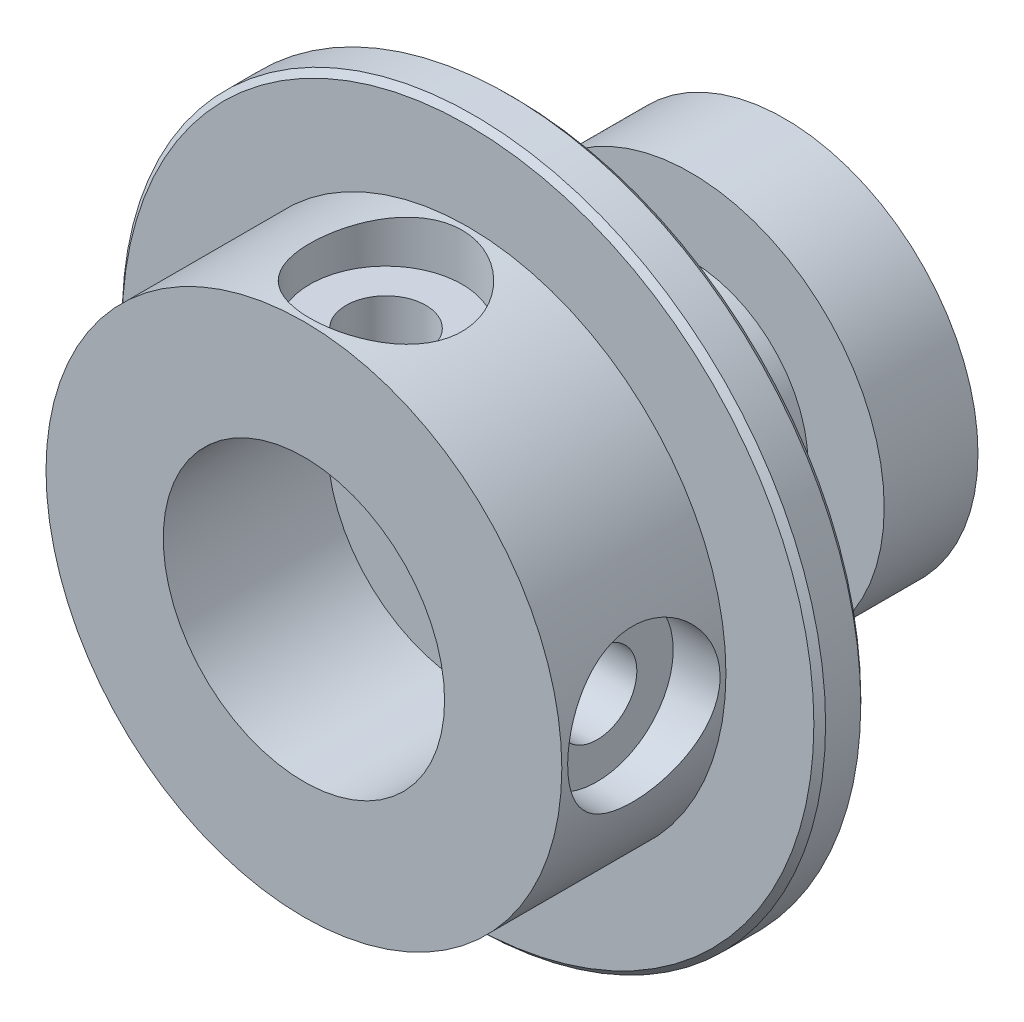
ISO-10303-21;
HEADER;
FILE_DESCRIPTION(('STEP AP214'),'2;1');
FILE_NAME('part.step','',(''),(''),'','','');
FILE_SCHEMA(('AUTOMOTIVE_DESIGN { 1 0 10303 214 1 1 1 1 }'));
ENDSEC;
DATA;
#1=APPLICATION_CONTEXT('core data for automotive mechanical design processes');
#2=APPLICATION_PROTOCOL_DEFINITION('international standard','automotive_design',2000,#1);
#3=PRODUCT_CONTEXT('',#1,'mechanical');
#4=PRODUCT('Part','Part','',(#3));
#5=PRODUCT_RELATED_PRODUCT_CATEGORY('part','',(#4));
#6=PRODUCT_DEFINITION_FORMATION('','',#4);
#7=PRODUCT_DEFINITION_CONTEXT('part definition',#1,'design');
#8=PRODUCT_DEFINITION('design','',#6,#7);
#9=PRODUCT_DEFINITION_SHAPE('','',#8);
#10=(LENGTH_UNIT() NAMED_UNIT(*) SI_UNIT(.MILLI.,.METRE.));
#11=(NAMED_UNIT(*) PLANE_ANGLE_UNIT() SI_UNIT($,.RADIAN.));
#12=(NAMED_UNIT(*) SI_UNIT($,.STERADIAN.) SOLID_ANGLE_UNIT());
#13=UNCERTAINTY_MEASURE_WITH_UNIT(LENGTH_MEASURE(1.E-05),#10,'distance_accuracy_value','');
#14=(GEOMETRIC_REPRESENTATION_CONTEXT(3) GLOBAL_UNCERTAINTY_ASSIGNED_CONTEXT((#13)) GLOBAL_UNIT_ASSIGNED_CONTEXT((#10,
#11,#12)) REPRESENTATION_CONTEXT('',''));
#15=CARTESIAN_POINT('',(0.,0.,0.));
#16=DIRECTION('',(0.,0.,1.));
#17=DIRECTION('',(1.,0.,0.));
#18=AXIS2_PLACEMENT_3D('',#15,#16,#17);
#19=CARTESIAN_POINT('',(0.,0.,17.8725165562914));
#20=DIRECTION('',(0.,0.,1.));
#21=DIRECTION('',(1.,0.,0.));
#22=AXIS2_PLACEMENT_3D('',#19,#20,#21);
#23=CYLINDRICAL_SURFACE('',#22,15.);
#24=CARTESIAN_POINT('',(0.,0.,-0.249999999999993));
#25=DIRECTION('',(0.,0.,1.));
#26=DIRECTION('',(1.,0.,0.));
#27=AXIS2_PLACEMENT_3D('',#24,#25,#26);
#28=CIRCLE('',#27,15.);
#29=CARTESIAN_POINT('',(15.,0.,-0.249999999999993));
#30=VERTEX_POINT('',#29);
#31=EDGE_CURVE('E126',#30,#30,#28,.F.);
#32=ORIENTED_EDGE('',*,*,#31,.T.);
#33=EDGE_LOOP('',(#32));
#34=FACE_BOUND('',#33,.T.);
#35=CARTESIAN_POINT('',(0.,0.,-1.75));
#36=DIRECTION('',(0.,0.,-1.));
#37=DIRECTION('',(-1.,0.,0.));
#38=AXIS2_PLACEMENT_3D('',#35,#36,#37);
#39=CIRCLE('',#38,15.);
#40=CARTESIAN_POINT('',(-15.,0.,-1.75));
#41=VERTEX_POINT('',#40);
#42=EDGE_CURVE('E130',#41,#41,#39,.F.);
#43=ORIENTED_EDGE('',*,*,#42,.T.);
#44=EDGE_LOOP('',(#43));
#45=FACE_BOUND('',#44,.T.);
#46=ADVANCED_FACE('F29',(#34,#45),#23,.T.);
#47=CARTESIAN_POINT('',(15.,0.,0.));
#48=DIRECTION('',(0.,0.,1.));
#49=DIRECTION('',(1.,0.,0.));
#50=AXIS2_PLACEMENT_3D('',#47,#48,#49);
#51=PLANE('',#50);
#52=CARTESIAN_POINT('',(0.,0.,0.));
#53=DIRECTION('',(0.,0.,1.));
#54=DIRECTION('',(1.,0.,0.));
#55=AXIS2_PLACEMENT_3D('',#52,#53,#54);
#56=CIRCLE('',#55,14.75);
#57=CARTESIAN_POINT('',(14.75,0.,0.));
#58=VERTEX_POINT('',#57);
#59=EDGE_CURVE('E129',#58,#58,#56,.T.);
#60=ORIENTED_EDGE('',*,*,#59,.T.);
#61=EDGE_LOOP('',(#60));
#62=FACE_BOUND('',#61,.T.);
#63=CARTESIAN_POINT('',(0.,0.,0.));
#64=DIRECTION('',(0.,0.,1.));
#65=DIRECTION('',(1.,0.,0.));
#66=AXIS2_PLACEMENT_3D('',#63,#64,#65);
#67=CIRCLE('',#66,11.);
#68=CARTESIAN_POINT('',(11.,0.,0.));
#69=VERTEX_POINT('',#68);
#70=EDGE_CURVE('E131',#69,#69,#67,.T.);
#71=ORIENTED_EDGE('',*,*,#70,.F.);
#72=EDGE_LOOP('',(#71));
#73=FACE_BOUND('',#72,.T.);
#74=ADVANCED_FACE('F98',(#62,#73),#51,.T.);
#75=CARTESIAN_POINT('',(0.,0.,17.8725165562914));
#76=DIRECTION('',(0.,0.,1.));
#77=DIRECTION('',(1.,0.,0.));
#78=AXIS2_PLACEMENT_3D('',#75,#76,#77);
#79=CYLINDRICAL_SURFACE('',#78,11.);
#80=CARTESIAN_POINT('',(0.,11.,6.75));
#81=CARTESIAN_POINT('',(0.178416200525788,10.9999982629152,6.74999750686824));
#82=CARTESIAN_POINT('',(0.356857684502548,10.9956175523928,6.7352593517928));
#83=CARTESIAN_POINT('',(0.708552170548665,10.9785696195956,6.67683093562602));
#84=CARTESIAN_POINT('',(0.881803472414992,10.9658997123218,6.63313129340144));
#85=CARTESIAN_POINT('',(1.21799361511338,10.9336631185642,6.51836057776038));
#86=CARTESIAN_POINT('',(1.38094700535914,10.9141064312081,6.4473291743824));
#87=CARTESIAN_POINT('',(1.69263050567293,10.8701337734514,6.28007174465877));
#88=CARTESIAN_POINT('',(1.84135884864192,10.8457172004917,6.18384259367159));
#89=CARTESIAN_POINT('',(2.12452471911474,10.7938710911554,5.96608819817471));
#90=CARTESIAN_POINT('',(2.25850872280044,10.766381219847,5.84398759039408));
#91=CARTESIAN_POINT('',(2.50442750950773,10.711850515102,5.57918304268664));
#92=CARTESIAN_POINT('',(2.61635871609676,10.6848097551506,5.43647576734712));
#93=CARTESIAN_POINT('',(2.81735580316089,10.6336037160478,5.1307025905559));
#94=CARTESIAN_POINT('',(2.90587269366478,10.6095135834049,4.96726205264409));
#95=CARTESIAN_POINT('',(3.05398146148509,10.567836073362,4.62698898740781));
#96=CARTESIAN_POINT('',(3.11358004922776,10.5502471875884,4.45015957796097));
#97=CARTESIAN_POINT('',(3.20053361220054,10.5241915738267,4.09321158244322));
#98=CARTESIAN_POINT('',(3.22872279293815,10.515489377792,3.91331385430887));
#99=CARTESIAN_POINT('',(3.25466173499448,10.5074915015991,3.55114827605063));
#100=CARTESIAN_POINT('',(3.2524186227942,10.5081936191856,3.36888099080526));
#101=CARTESIAN_POINT('',(3.21821288008835,10.5187160524273,3.01389385058143));
#102=CARTESIAN_POINT('',(3.18729009915699,10.5282173165492,2.84106278370232));
#103=CARTESIAN_POINT('',(3.09828077037294,10.5547520879428,2.50315980197127));
#104=CARTESIAN_POINT('',(3.04019161449498,10.5717863183854,2.33808863375964));
#105=CARTESIAN_POINT('',(2.89772116836689,10.6117259480155,2.01782411510133));
#106=CARTESIAN_POINT('',(2.81299878689647,10.6347067886268,1.86279230935397));
#107=CARTESIAN_POINT('',(2.61990401720037,10.6839134086454,1.56879528056499));
#108=CARTESIAN_POINT('',(2.51152604652091,10.7101399533689,1.42983386181652));
#109=CARTESIAN_POINT('',(2.26901036089282,10.7641817643693,1.16601792553688));
#110=CARTESIAN_POINT('',(2.13400818168477,10.7920183884227,1.04196111913097));
#111=CARTESIAN_POINT('',(1.84476968734143,10.8452024744328,0.818065469554462));
#112=CARTESIAN_POINT('',(1.69053223387971,10.8705497889155,0.718228060696964));
#113=CARTESIAN_POINT('',(1.36578242776513,10.9161191004876,0.545140359484794));
#114=CARTESIAN_POINT('',(1.19517324096604,10.9363076408998,0.472062352595274));
#115=CARTESIAN_POINT('',(0.843352064713758,10.9690436371049,0.355870360828144));
#116=CARTESIAN_POINT('',(0.662142954646591,10.9815931575095,0.312748279263108));
#117=CARTESIAN_POINT('',(0.301051022421962,10.9973125944041,0.259009427349263));
#118=CARTESIAN_POINT('',(0.121342504656699,11.0007944814802,0.247311064390037));
#119=CARTESIAN_POINT('',(-0.237479309027752,10.9988989765161,0.253726538048913));
#120=CARTESIAN_POINT('',(-0.41659267879706,10.9935227281854,0.27183652599033));
#121=CARTESIAN_POINT('',(-0.765089204769939,10.9747189225515,0.336478049818664));
#122=CARTESIAN_POINT('',(-0.934599338679167,10.9614693564279,0.382381679742991));
#123=CARTESIAN_POINT('',(-1.26347838477173,10.9284473709533,0.500555763420318));
#124=CARTESIAN_POINT('',(-1.42284608911298,10.9086741764437,0.572829350645134));
#125=CARTESIAN_POINT('',(-1.73092810927509,10.864100600291,0.743534133771883));
#126=CARTESIAN_POINT('',(-1.8793190398845,10.839196421442,0.842521139791958));
#127=CARTESIAN_POINT('',(-2.15775406349061,10.7872235499124,1.06316430717956));
#128=CARTESIAN_POINT('',(-2.28779368027647,10.7601543316544,1.18482598256498));
#129=CARTESIAN_POINT('',(-2.5305690256182,10.7057116198147,1.45244331618519));
#130=CARTESIAN_POINT('',(-2.64253591732971,10.678360871854,1.59910255545364));
#131=CARTESIAN_POINT('',(-2.84031839967537,10.6274671699012,1.90972163417897));
#132=CARTESIAN_POINT('',(-2.92613475656903,10.6039241043464,2.07368096652125));
#133=CARTESIAN_POINT('',(-3.0685785671433,10.563584297642,2.41366841788033));
#134=CARTESIAN_POINT('',(-3.125348759465,10.5467546571657,2.58963260681975));
#135=CARTESIAN_POINT('',(-3.20829306130572,10.5218233978856,2.94920987185761));
#136=CARTESIAN_POINT('',(-3.23447725738003,10.5137189017998,3.13282040566952));
#137=CARTESIAN_POINT('',(-3.25483481740912,10.5074330600216,3.49450857075879));
#138=CARTESIAN_POINT('',(-3.25025880564275,10.5088640086122,3.67251001110831));
#139=CARTESIAN_POINT('',(-3.21219909180689,10.5205591390718,4.02508437236258));
#140=CARTESIAN_POINT('',(-3.17871648316447,10.5308229868257,4.19965742269488));
#141=CARTESIAN_POINT('',(-3.08459032141991,10.5587713422918,4.53844263513607));
#142=CARTESIAN_POINT('',(-3.02426846146637,10.5763678078556,4.70275197100598));
#143=CARTESIAN_POINT('',(-2.8784258747993,10.6169849138518,5.01904882586346));
#144=CARTESIAN_POINT('',(-2.79290043880012,10.6400065678188,5.17103403531562));
#145=CARTESIAN_POINT('',(-2.59552615930267,10.6898989480729,5.46419589347849));
#146=CARTESIAN_POINT('',(-2.48285155009475,10.7168772014602,5.60479829227895));
#147=CARTESIAN_POINT('',(-2.23587558262117,10.7711104715062,5.86550530500168));
#148=CARTESIAN_POINT('',(-2.10156867112467,10.7983655575428,5.98560463922853));
#149=CARTESIAN_POINT('',(-1.81060024235673,10.8509981589886,6.20524879689119));
#150=CARTESIAN_POINT('',(-1.65341722294164,10.876301534638,6.30412233523691));
#151=CARTESIAN_POINT('',(-1.32391105165359,10.9213019215798,6.47389777361029));
#152=CARTESIAN_POINT('',(-1.15159542276487,10.941001698212,6.54481347734023));
#153=CARTESIAN_POINT('',(-0.817213646208473,10.9707349804926,6.64988143448891));
#154=CARTESIAN_POINT('',(-0.656251582752156,10.9816202585526,6.68732633609511));
#155=CARTESIAN_POINT('',(-0.330199799142936,10.9962530160955,6.73738483827528));
#156=CARTESIAN_POINT('',(-0.16511072607836,11.0000016075409,6.75000230720526));
#157=CARTESIAN_POINT('',(0.,11.,6.75));
#158=B_SPLINE_CURVE_WITH_KNOTS('',3,(#80,#81,#82,#83,#84,#85,#86,#87,#88,#89,#90,#91,#92,#93,
#94,#95,#96,#97,#98,#99,#100,#101,#102,#103,#104,#105,#106,#107,#108,#109,#110,#111,#112,#113,
#114,#115,#116,#117,#118,#119,#120,#121,#122,#123,#124,#125,#126,#127,#128,#129,#130,#131,#132,
#133,#134,#135,#136,#137,#138,#139,#140,#141,#142,#143,#144,#145,#146,#147,#148,#149,#150,#151,
#152,#153,#154,#155,#156,#157),.UNSPECIFIED.,.T.,.F.,(4,2,2,2,2,2,2,2,2,2,2,2,2,2,2,2,2,2,2,2,2,
2,2,2,2,2,2,2,2,2,2,2,2,2,2,2,2,2,4),(0.,0.534642255191399,1.06945777507671,1.60349995995266,
2.13760840000784,2.68515054522155,3.23278141562259,3.7922979521507,4.35168459197638,
4.89583136550319,5.43985071568068,5.96488549760793,6.48997069425411,7.02207520219665,
7.55430541686271,8.1080584213772,8.66184421206635,9.21913524098035,9.77627558288728,
10.3139777641733,10.8516105260028,11.3775282379943,11.9035084637508,12.441411755842,
12.979446026142,13.5363909457622,14.0933195442864,14.647484344206,15.2014663417312,
15.7330651787558,16.2646439082909,16.7900159757287,17.3154862711942,17.8595865880715,
18.4038268042775,18.9633376766043,19.5225719530096,20.0174201117069,20.512191162131),.UNSPECIFIED.);
#159=CARTESIAN_POINT('',(0.,11.,6.75));
#160=VERTEX_POINT('',#159);
#161=EDGE_CURVE('E36',#160,#160,#158,.T.);
#162=ORIENTED_EDGE('',*,*,#161,.F.);
#163=EDGE_LOOP('',(#162));
#164=FACE_BOUND('',#163,.T.);
#165=CARTESIAN_POINT('',(11.,0.,0.25));
#166=CARTESIAN_POINT('',(10.9999982629152,0.178416200525788,0.250002493131761));
#167=CARTESIAN_POINT('',(10.9956175523928,0.356857684502548,0.264740648207198));
#168=CARTESIAN_POINT('',(10.9785696195956,0.708552170548666,0.323169064373983));
#169=CARTESIAN_POINT('',(10.9658997123218,0.881803472414992,0.366868706598559));
#170=CARTESIAN_POINT('',(10.9336631185642,1.21799361511338,0.481639422239624));
#171=CARTESIAN_POINT('',(10.9141064312081,1.38094700535914,0.552670825617601));
#172=CARTESIAN_POINT('',(10.8701337734514,1.69263050567293,0.719928255341229));
#173=CARTESIAN_POINT('',(10.8457172004917,1.84135884864192,0.816157406328416));
#174=CARTESIAN_POINT('',(10.7938710911554,2.12452471911474,1.03391180182529));
#175=CARTESIAN_POINT('',(10.766381219847,2.25850872280044,1.15601240960592));
#176=CARTESIAN_POINT('',(10.711850515102,2.50442750950773,1.42081695731336));
#177=CARTESIAN_POINT('',(10.6848097551506,2.61635871609676,1.56352423265288));
#178=CARTESIAN_POINT('',(10.6336037160478,2.81735580316089,1.86929740944409));
#179=CARTESIAN_POINT('',(10.6095135834049,2.90587269366478,2.03273794735591));
#180=CARTESIAN_POINT('',(10.567836073362,3.05398146148509,2.37301101259219));
#181=CARTESIAN_POINT('',(10.5502471875884,3.11358004922776,2.54984042203903));
#182=CARTESIAN_POINT('',(10.5241915738267,3.20053361220054,2.90678841755678));
#183=CARTESIAN_POINT('',(10.515489377792,3.22872279293815,3.08668614569113));
#184=CARTESIAN_POINT('',(10.5074915015991,3.25466173499448,3.44885172394937));
#185=CARTESIAN_POINT('',(10.5081936191856,3.2524186227942,3.63111900919474));
#186=CARTESIAN_POINT('',(10.5187160524273,3.21821288008835,3.98610614941857));
#187=CARTESIAN_POINT('',(10.5282173165492,3.18729009915699,4.15893721629768));
#188=CARTESIAN_POINT('',(10.5547520879428,3.09828077037294,4.49684019802873));
#189=CARTESIAN_POINT('',(10.5717863183854,3.04019161449498,4.66191136624036));
#190=CARTESIAN_POINT('',(10.6117259480155,2.89772116836689,4.98217588489867));
#191=CARTESIAN_POINT('',(10.6347067886268,2.81299878689647,5.13720769064603));
#192=CARTESIAN_POINT('',(10.6839134086454,2.61990401720037,5.43120471943501));
#193=CARTESIAN_POINT('',(10.7101399533689,2.51152604652091,5.57016613818348));
#194=CARTESIAN_POINT('',(10.7641817643693,2.26901036089282,5.83398207446312));
#195=CARTESIAN_POINT('',(10.7920183884227,2.13400818168477,5.95803888086903));
#196=CARTESIAN_POINT('',(10.8452024744328,1.84476968734143,6.18193453044554));
#197=CARTESIAN_POINT('',(10.8705497889155,1.69053223387971,6.28177193930304));
#198=CARTESIAN_POINT('',(10.9161191004876,1.36578242776513,6.45485964051521));
#199=CARTESIAN_POINT('',(10.9363076408998,1.19517324096603,6.52793764740473));
#200=CARTESIAN_POINT('',(10.9690436371049,0.843352064713757,6.64412963917186));
#201=CARTESIAN_POINT('',(10.9815931575095,0.66214295464659,6.68725172073689));
#202=CARTESIAN_POINT('',(10.9973125944041,0.301051022421961,6.74099057265074));
#203=CARTESIAN_POINT('',(11.0007944814802,0.121342504656697,6.75268893560996));
#204=CARTESIAN_POINT('',(10.9988989765161,-0.237479309027754,6.74627346195109));
#205=CARTESIAN_POINT('',(10.9935227281854,-0.416592678797061,6.72816347400967));
#206=CARTESIAN_POINT('',(10.9747189225515,-0.765089204769939,6.66352195018134));
#207=CARTESIAN_POINT('',(10.9614693564279,-0.934599338679168,6.61761832025701));
#208=CARTESIAN_POINT('',(10.9284473709533,-1.26347838477173,6.49944423657968));
#209=CARTESIAN_POINT('',(10.9086741764437,-1.42284608911298,6.42717064935487));
#210=CARTESIAN_POINT('',(10.864100600291,-1.73092810927509,6.25646586622812));
#211=CARTESIAN_POINT('',(10.839196421442,-1.8793190398845,6.15747886020804));
#212=CARTESIAN_POINT('',(10.7872235499124,-2.15775406349061,5.93683569282044));
#213=CARTESIAN_POINT('',(10.7601543316544,-2.28779368027647,5.81517401743502));
#214=CARTESIAN_POINT('',(10.7057116198147,-2.5305690256182,5.54755668381481));
#215=CARTESIAN_POINT('',(10.678360871854,-2.64253591732971,5.40089744454636));
#216=CARTESIAN_POINT('',(10.6274671699012,-2.84031839967537,5.09027836582103));
#217=CARTESIAN_POINT('',(10.6039241043464,-2.92613475656903,4.92631903347875));
#218=CARTESIAN_POINT('',(10.563584297642,-3.0685785671433,4.58633158211967));
#219=CARTESIAN_POINT('',(10.5467546571657,-3.125348759465,4.41036739318026));
#220=CARTESIAN_POINT('',(10.5218233978856,-3.20829306130572,4.05079012814239));
#221=CARTESIAN_POINT('',(10.5137189017998,-3.23447725738003,3.86717959433048));
#222=CARTESIAN_POINT('',(10.5074330600216,-3.25483481740912,3.50549142924121));
#223=CARTESIAN_POINT('',(10.5088640086122,-3.25025880564275,3.32748998889169));
#224=CARTESIAN_POINT('',(10.5205591390718,-3.21219909180689,2.97491562763742));
#225=CARTESIAN_POINT('',(10.5308229868257,-3.17871648316447,2.80034257730512));
#226=CARTESIAN_POINT('',(10.5587713422918,-3.08459032141991,2.46155736486393));
#227=CARTESIAN_POINT('',(10.5763678078556,-3.02426846146637,2.29724802899402));
#228=CARTESIAN_POINT('',(10.6169849138518,-2.8784258747993,1.98095117413654));
#229=CARTESIAN_POINT('',(10.6400065678188,-2.79290043880012,1.82896596468439));
#230=CARTESIAN_POINT('',(10.6898989480729,-2.59552615930267,1.53580410652151));
#231=CARTESIAN_POINT('',(10.7168772014602,-2.48285155009475,1.39520170772105));
#232=CARTESIAN_POINT('',(10.7711104715062,-2.23587558262117,1.13449469499832));
#233=CARTESIAN_POINT('',(10.7983655575428,-2.10156867112467,1.01439536077147));
#234=CARTESIAN_POINT('',(10.8509981589886,-1.81060024235673,0.794751203108805));
#235=CARTESIAN_POINT('',(10.876301534638,-1.65341722294163,0.695877664763091));
#236=CARTESIAN_POINT('',(10.9213019215798,-1.32391105165358,0.52610222638971));
#237=CARTESIAN_POINT('',(10.941001698212,-1.15159542276487,0.455186522659772));
#238=CARTESIAN_POINT('',(10.9707349804926,-0.817213646208472,0.350118565511086));
#239=CARTESIAN_POINT('',(10.9816202585526,-0.656251582752154,0.312673663904894));
#240=CARTESIAN_POINT('',(10.9962530160955,-0.330199799142934,0.262615161724717));
#241=CARTESIAN_POINT('',(11.0000016075409,-0.165110726078359,0.249997692794745));
#242=CARTESIAN_POINT('',(11.,0.,0.25));
#243=B_SPLINE_CURVE_WITH_KNOTS('',3,(#165,#166,#167,#168,#169,#170,#171,#172,#173,#174,#175,
#176,#177,#178,#179,#180,#181,#182,#183,#184,#185,#186,#187,#188,#189,#190,#191,#192,#193,#194,
#195,#196,#197,#198,#199,#200,#201,#202,#203,#204,#205,#206,#207,#208,#209,#210,#211,#212,#213,
#214,#215,#216,#217,#218,#219,#220,#221,#222,#223,#224,#225,#226,#227,#228,#229,#230,#231,#232,
#233,#234,#235,#236,#237,#238,#239,#240,#241,#242),.UNSPECIFIED.,.T.,.F.,(4,2,2,2,2,2,2,2,2,2,2,
2,2,2,2,2,2,2,2,2,2,2,2,2,2,2,2,2,2,2,2,2,2,2,2,2,2,2,4),(0.,0.534642255191399,1.06945777507671,
1.60349995995266,2.13760840000784,2.68515054522155,3.23278141562258,3.7922979521507,
4.35168459197638,4.89583136550318,5.43985071568068,5.96488549760793,6.48997069425411,
7.02207520219665,7.55430541686271,8.1080584213772,8.66184421206635,9.21913524098035,
9.77627558288727,10.3139777641733,10.8516105260028,11.3775282379943,11.9035084637508,
12.441411755842,12.979446026142,13.5363909457622,14.0933195442864,14.647484344206,
15.2014663417312,15.7330651787558,16.2646439082909,16.7900159757287,17.3154862711942,
17.8595865880715,18.4038268042774,18.9633376766043,19.5225719530096,20.0174201117069,
20.512191162131),.UNSPECIFIED.);
#244=CARTESIAN_POINT('',(11.,0.,0.25));
#245=VERTEX_POINT('',#244);
#246=EDGE_CURVE('E40',#245,#245,#243,.T.);
#247=ORIENTED_EDGE('',*,*,#246,.F.);
#248=EDGE_LOOP('',(#247));
#249=FACE_BOUND('',#248,.T.);
#250=ORIENTED_EDGE('',*,*,#70,.T.);
#251=EDGE_LOOP('',(#250));
#252=FACE_BOUND('',#251,.T.);
#253=CARTESIAN_POINT('',(0.,0.,7.));
#254=DIRECTION('',(0.,0.,1.));
#255=DIRECTION('',(1.,0.,0.));
#256=AXIS2_PLACEMENT_3D('',#253,#254,#255);
#257=CIRCLE('',#256,11.);
#258=CARTESIAN_POINT('',(11.,0.,7.));
#259=VERTEX_POINT('',#258);
#260=EDGE_CURVE('E136',#259,#259,#257,.T.);
#261=ORIENTED_EDGE('',*,*,#260,.F.);
#262=EDGE_LOOP('',(#261));
#263=FACE_BOUND('',#262,.T.);
#264=ADVANCED_FACE('F60',(#164,#249,#252,#263),#79,.T.);
#265=CARTESIAN_POINT('',(6.,0.,7.));
#266=DIRECTION('',(0.,0.,1.));
#267=DIRECTION('',(1.,0.,0.));
#268=AXIS2_PLACEMENT_3D('',#265,#266,#267);
#269=PLANE('',#268);
#270=ORIENTED_EDGE('',*,*,#260,.T.);
#271=EDGE_LOOP('',(#270));
#272=FACE_BOUND('',#271,.T.);
#273=CARTESIAN_POINT('',(0.,0.,7.));
#274=DIRECTION('',(0.,0.,1.));
#275=DIRECTION('',(1.,0.,0.));
#276=AXIS2_PLACEMENT_3D('',#273,#274,#275);
#277=CIRCLE('',#276,6.);
#278=CARTESIAN_POINT('',(6.,0.,7.));
#279=VERTEX_POINT('',#278);
#280=EDGE_CURVE('E159',#279,#279,#277,.T.);
#281=ORIENTED_EDGE('',*,*,#280,.F.);
#282=EDGE_LOOP('',(#281));
#283=FACE_BOUND('',#282,.T.);
#284=ADVANCED_FACE('F89',(#272,#283),#269,.T.);
#285=CARTESIAN_POINT('',(0.,0.,17.8725165562914));
#286=DIRECTION('',(0.,0.,1.));
#287=DIRECTION('',(1.,0.,0.));
#288=AXIS2_PLACEMENT_3D('',#285,#286,#287);
#289=CYLINDRICAL_SURFACE('',#288,6.);
#290=CARTESIAN_POINT('',(0.,6.,5.2));
#291=CARTESIAN_POINT('',(-0.0934943615034011,5.99999884474973,5.19999827257656));
#292=CARTESIAN_POINT('',(-0.187006564522406,5.99779348954783,5.19226144726258));
#293=CARTESIAN_POINT('',(-0.371322769901869,5.98921065514552,5.16158237131766));
#294=CARTESIAN_POINT('',(-0.462125697324879,5.9828315423807,5.13863416706837));
#295=CARTESIAN_POINT('',(-0.638337255167614,5.96660280778705,5.07834909427065));
#296=CARTESIAN_POINT('',(-0.72375314587583,5.95675798000671,5.0410320951117));
#297=CARTESIAN_POINT('',(-0.887114983810656,5.93462982256612,4.95314623450544));
#298=CARTESIAN_POINT('',(-0.965060183916336,5.92234624939093,4.90257604953212));
#299=CARTESIAN_POINT('',(-1.11328637042325,5.89630337319782,4.78823799703864));
#300=CARTESIAN_POINT('',(-1.18334643738982,5.88251635209784,4.72419005108989));
#301=CARTESIAN_POINT('',(-1.31188873147318,5.855192174518,4.58531237424007));
#302=CARTESIAN_POINT('',(-1.3703692555204,5.84165505505769,4.51048106015959));
#303=CARTESIAN_POINT('',(-1.47521073956825,5.81607525435004,4.35034613797821));
#304=CARTESIAN_POINT('',(-1.52131004368505,5.80406729594488,4.26486516017766));
#305=CARTESIAN_POINT('',(-1.59839223988139,5.78331625999126,4.08696976467728));
#306=CARTESIAN_POINT('',(-1.62937832337737,5.77457249324418,3.99455681554211));
#307=CARTESIAN_POINT('',(-1.6745729227202,5.76162732490899,3.8078845980668));
#308=CARTESIAN_POINT('',(-1.6891853373279,5.75731679770698,3.71373087719834));
#309=CARTESIAN_POINT('',(-1.70247807029528,5.75340078755233,3.52421729173523));
#310=CARTESIAN_POINT('',(-1.701161787085,5.7537943009799,3.42885768875567));
#311=CARTESIAN_POINT('',(-1.68295347341345,5.7591447009774,3.24285467883646));
#312=CARTESIAN_POINT('',(-1.66655840082521,5.76395598115783,3.15215775573753));
#313=CARTESIAN_POINT('',(-1.61945723532089,5.77736548810719,2.97485814394547));
#314=CARTESIAN_POINT('',(-1.58874986788554,5.78596405213248,2.8882558206358));
#315=CARTESIAN_POINT('',(-1.51351000123897,5.80610149854683,2.72034738034602));
#316=CARTESIAN_POINT('',(-1.46880968051772,5.81767575077005,2.6391208863769));
#317=CARTESIAN_POINT('',(-1.3669696193658,5.84244242021042,2.48515105122669));
#318=CARTESIAN_POINT('',(-1.30982715018844,5.8556351921153,2.41240957631826));
#319=CARTESIAN_POINT('',(-1.1822192440219,5.88275097092072,2.27464505572174));
#320=CARTESIAN_POINT('',(-1.11133880736879,5.89668292807973,2.21000757547062));
#321=CARTESIAN_POINT('',(-0.959571971132521,5.92327174812674,2.09345231774435));
#322=CARTESIAN_POINT('',(-0.878685070277582,5.93592854707829,2.04153517788067));
#323=CARTESIAN_POINT('',(-0.708554093591205,5.95863625978762,1.95169378425825));
#324=CARTESIAN_POINT('',(-0.61926707590929,5.96867266972164,1.91384694014061));
#325=CARTESIAN_POINT('',(-0.435246656631161,5.98490423413323,1.85381632142806));
#326=CARTESIAN_POINT('',(-0.340514610508732,5.99110034012117,1.83162866677377));
#327=CARTESIAN_POINT('',(-0.151577478778788,5.99880603608526,1.80416933109925));
#328=CARTESIAN_POINT('',(-0.0574542537963851,6.00046057332172,1.79837427817423));
#329=CARTESIAN_POINT('',(0.130421977345628,5.9993175792947,1.8024087955584));
#330=CARTESIAN_POINT('',(0.224175025822195,5.99652057260661,1.81223652485962));
#331=CARTESIAN_POINT('',(0.406729377316999,5.98688305950992,1.84681107590712));
#332=CARTESIAN_POINT('',(0.495591923936865,5.98012355710591,1.87125921361148));
#333=CARTESIAN_POINT('',(0.667940689340888,5.96333456274325,1.93402767587396));
#334=CARTESIAN_POINT('',(0.75142628957672,5.95330469537305,1.97234959308599));
#335=CARTESIAN_POINT('',(0.912632709702029,5.93075651627411,2.0627032728876));
#336=CARTESIAN_POINT('',(0.990191980587498,5.91818955622034,2.11501081116548));
#337=CARTESIAN_POINT('',(1.13561335455067,5.89201584767508,2.23151002389545));
#338=CARTESIAN_POINT('',(1.20347328266756,5.87840886701804,2.29570435643324));
#339=CARTESIAN_POINT('',(1.32982443029663,5.85114386688352,2.43660706202708));
#340=CARTESIAN_POINT('',(1.38794463053242,5.83749825142035,2.5136512094729));
#341=CARTESIAN_POINT('',(1.49044819284287,5.81217362193036,2.67669281369744));
#342=CARTESIAN_POINT('',(1.53483204834056,5.8004945372707,2.7626899487277));
#343=CARTESIAN_POINT('',(1.60827718214857,5.78056173167497,2.94082839937613));
#344=CARTESIAN_POINT('',(1.63742092705124,5.77228962787091,3.03293354271728));
#345=CARTESIAN_POINT('',(1.67971782463611,5.7601251451254,3.22101652224137));
#346=CARTESIAN_POINT('',(1.69287572248445,5.75623146653765,3.31699320047123));
#347=CARTESIAN_POINT('',(1.70252951716922,5.75338292703647,3.50627001476008));
#348=CARTESIAN_POINT('',(1.69962567840781,5.75425013160161,3.59953728637873));
#349=CARTESIAN_POINT('',(1.67865052041337,5.76040357418625,3.78419429237689));
#350=CARTESIAN_POINT('',(1.66057969167523,5.76568966930041,3.87558408737539));
#351=CARTESIAN_POINT('',(1.61015145481414,5.77997263333106,4.0530269910296));
#352=CARTESIAN_POINT('',(1.57793668021413,5.78893239723693,4.1391238371912));
#353=CARTESIAN_POINT('',(1.50024531465022,5.80955007293793,4.30475829364648));
#354=CARTESIAN_POINT('',(1.45476640929609,5.82120845552789,4.38429475614293));
#355=CARTESIAN_POINT('',(1.35008379150968,5.8463884630186,4.53737751931617));
#356=CARTESIAN_POINT('',(1.29047793558559,5.85995875148063,4.61064083646234));
#357=CARTESIAN_POINT('',(1.15997819757439,5.88717982502643,4.74632007551774));
#358=CARTESIAN_POINT('',(1.08908149062451,5.9008306294293,4.80873327463631));
#359=CARTESIAN_POINT('',(0.935867716703176,5.92708482484926,4.92249103235592));
#360=CARTESIAN_POINT('',(0.853308739764465,5.93965334227066,4.97351858339861));
#361=CARTESIAN_POINT('',(0.68042808386356,5.96192854356138,5.06089262257089));
#362=CARTESIAN_POINT('',(0.590110778092925,5.97163682618413,5.09724731644335));
#363=CARTESIAN_POINT('',(0.416948403338606,5.98603807698347,5.15021388257584));
#364=CARTESIAN_POINT('',(0.334755102796877,5.99123321349682,5.16883690968153));
#365=CARTESIAN_POINT('',(0.168379186148406,5.99821447554217,5.19372995029414));
#366=CARTESIAN_POINT('',(0.0841968278048551,6.00000104036657,5.20000155564006));
#367=CARTESIAN_POINT('',(0.,6.,5.2));
#368=B_SPLINE_CURVE_WITH_KNOTS('',3,(#290,#291,#292,#293,#294,#295,#296,#297,#298,#299,#300,
#301,#302,#303,#304,#305,#306,#307,#308,#309,#310,#311,#312,#313,#314,#315,#316,#317,#318,#319,
#320,#321,#322,#323,#324,#325,#326,#327,#328,#329,#330,#331,#332,#333,#334,#335,#336,#337,#338,
#339,#340,#341,#342,#343,#344,#345,#346,#347,#348,#349,#350,#351,#352,#353,#354,#355,#356,#357,
#358,#359,#360,#361,#362,#363,#364,#365,#366,#367),.UNSPECIFIED.,.T.,.F.,(4,2,2,2,2,2,2,2,2,2,2,
2,2,2,2,2,2,2,2,2,2,2,2,2,2,2,2,2,2,2,2,2,2,2,2,2,2,2,4),(0.,0.280174071102461,
0.560457865011477,0.84035546210045,1.12028102174912,1.40672953049703,1.69322013762187,
1.98535867662736,2.27743549881932,2.56213698300402,2.84677772644094,3.12236111340167,
3.39796904593474,3.67701797004889,3.95612815546202,4.2455739480468,4.53503424623541,
4.82606427553573,5.11702216760167,5.39857959937196,5.68010385452595,5.95606435426586,
6.23205654320784,6.5139534764587,6.79591352286413,7.08693188503409,7.37793979232426,
7.66735627667047,7.9566868309371,8.23527925900377,8.51386267784061,8.78969905467388,
9.06558358960691,9.35054020592989,9.63556822799411,9.92774771861144,10.2197635817238,
10.4721083055922,10.7244205053941),.UNSPECIFIED.);
#369=CARTESIAN_POINT('',(0.,6.,5.2));
#370=VERTEX_POINT('',#369);
#371=EDGE_CURVE('E55',#370,#370,#368,.T.);
#372=ORIENTED_EDGE('',*,*,#371,.F.);
#373=EDGE_LOOP('',(#372));
#374=FACE_BOUND('',#373,.T.);
#375=CARTESIAN_POINT('',(6.,0.,1.8));
#376=CARTESIAN_POINT('',(5.99999884474973,-0.0934943615034009,1.80000172742344));
#377=CARTESIAN_POINT('',(5.99779348954783,-0.187006564522406,1.80773855273742));
#378=CARTESIAN_POINT('',(5.98921065514552,-0.371322769901869,1.83841762868234));
#379=CARTESIAN_POINT('',(5.9828315423807,-0.462125697324879,1.86136583293163));
#380=CARTESIAN_POINT('',(5.96660280778705,-0.638337255167614,1.92165090572936));
#381=CARTESIAN_POINT('',(5.95675798000671,-0.72375314587583,1.9589679048883));
#382=CARTESIAN_POINT('',(5.93462982256612,-0.887114983810656,2.04685376549456));
#383=CARTESIAN_POINT('',(5.92234624939093,-0.965060183916336,2.09742395046788));
#384=CARTESIAN_POINT('',(5.89630337319782,-1.11328637042325,2.21176200296136));
#385=CARTESIAN_POINT('',(5.88251635209784,-1.18334643738982,2.27580994891011));
#386=CARTESIAN_POINT('',(5.855192174518,-1.31188873147317,2.41468762575993));
#387=CARTESIAN_POINT('',(5.84165505505769,-1.37036925552041,2.48951893984041));
#388=CARTESIAN_POINT('',(5.81607525435004,-1.47521073956825,2.64965386202178));
#389=CARTESIAN_POINT('',(5.80406729594488,-1.52131004368505,2.73513483982234));
#390=CARTESIAN_POINT('',(5.78331625999126,-1.59839223988139,2.91303023532272));
#391=CARTESIAN_POINT('',(5.77457249324418,-1.62937832337737,3.00544318445789));
#392=CARTESIAN_POINT('',(5.76162732490899,-1.6745729227202,3.1921154019332));
#393=CARTESIAN_POINT('',(5.75731679770698,-1.6891853373279,3.28626912280166));
#394=CARTESIAN_POINT('',(5.75340078755233,-1.70247807029528,3.47578270826477));
#395=CARTESIAN_POINT('',(5.7537943009799,-1.701161787085,3.57114231124433));
#396=CARTESIAN_POINT('',(5.7591447009774,-1.68295347341345,3.75714532116355));
#397=CARTESIAN_POINT('',(5.76395598115784,-1.66655840082521,3.84784224426247));
#398=CARTESIAN_POINT('',(5.77736548810719,-1.61945723532089,4.02514185605453));
#399=CARTESIAN_POINT('',(5.78596405213248,-1.58874986788554,4.1117441793642));
#400=CARTESIAN_POINT('',(5.80610149854683,-1.51351000123897,4.27965261965398));
#401=CARTESIAN_POINT('',(5.81767575077005,-1.46880968051772,4.3608791136231));
#402=CARTESIAN_POINT('',(5.84244242021042,-1.36696961936581,4.51484894877331));
#403=CARTESIAN_POINT('',(5.8556351921153,-1.30982715018844,4.58759042368174));
#404=CARTESIAN_POINT('',(5.88275097092072,-1.1822192440219,4.72535494427826));
#405=CARTESIAN_POINT('',(5.89668292807973,-1.11133880736879,4.78999242452938));
#406=CARTESIAN_POINT('',(5.92327174812674,-0.959571971132521,4.90654768225565));
#407=CARTESIAN_POINT('',(5.93592854707829,-0.878685070277581,4.95846482211933));
#408=CARTESIAN_POINT('',(5.95863625978762,-0.708554093591204,5.04830621574175));
#409=CARTESIAN_POINT('',(5.96867266972164,-0.619267075909289,5.08615305985939));
#410=CARTESIAN_POINT('',(5.98490423413323,-0.435246656631161,5.14618367857194));
#411=CARTESIAN_POINT('',(5.99110034012117,-0.340514610508731,5.16837133322623));
#412=CARTESIAN_POINT('',(5.99880603608526,-0.151577478778788,5.19583066890075));
#413=CARTESIAN_POINT('',(6.00046057332172,-0.057454253796385,5.20162572182577));
#414=CARTESIAN_POINT('',(5.9993175792947,0.130421977345628,5.1975912044416));
#415=CARTESIAN_POINT('',(5.99652057260661,0.224175025822195,5.18776347514038));
#416=CARTESIAN_POINT('',(5.98688305950992,0.406729377316999,5.15318892409288));
#417=CARTESIAN_POINT('',(5.98012355710591,0.495591923936865,5.12874078638852));
#418=CARTESIAN_POINT('',(5.96333456274325,0.667940689340888,5.06597232412604));
#419=CARTESIAN_POINT('',(5.95330469537305,0.75142628957672,5.02765040691401));
#420=CARTESIAN_POINT('',(5.93075651627411,0.912632709702029,4.9372967271124));
#421=CARTESIAN_POINT('',(5.91818955622034,0.990191980587498,4.88498918883452));
#422=CARTESIAN_POINT('',(5.89201584767508,1.13561335455067,4.76848997610455));
#423=CARTESIAN_POINT('',(5.87840886701804,1.20347328266756,4.70429564356676));
#424=CARTESIAN_POINT('',(5.85114386688352,1.32982443029663,4.56339293797292));
#425=CARTESIAN_POINT('',(5.83749825142035,1.38794463053242,4.4863487905271));
#426=CARTESIAN_POINT('',(5.81217362193036,1.49044819284287,4.32330718630256));
#427=CARTESIAN_POINT('',(5.8004945372707,1.53483204834056,4.2373100512723));
#428=CARTESIAN_POINT('',(5.78056173167497,1.60827718214857,4.05917160062387));
#429=CARTESIAN_POINT('',(5.77228962787091,1.63742092705124,3.96706645728272));
#430=CARTESIAN_POINT('',(5.7601251451254,1.67971782463611,3.77898347775863));
#431=CARTESIAN_POINT('',(5.75623146653765,1.69287572248445,3.68300679952877));
#432=CARTESIAN_POINT('',(5.75338292703647,1.70252951716922,3.49372998523992));
#433=CARTESIAN_POINT('',(5.75425013160161,1.69962567840781,3.40046271362127));
#434=CARTESIAN_POINT('',(5.76040357418625,1.67865052041337,3.21580570762311));
#435=CARTESIAN_POINT('',(5.76568966930041,1.66057969167523,3.12441591262461));
#436=CARTESIAN_POINT('',(5.77997263333106,1.61015145481414,2.9469730089704));
#437=CARTESIAN_POINT('',(5.78893239723693,1.57793668021413,2.8608761628088));
#438=CARTESIAN_POINT('',(5.80955007293793,1.50024531465022,2.69524170635352));
#439=CARTESIAN_POINT('',(5.82120845552789,1.45476640929609,2.61570524385707));
#440=CARTESIAN_POINT('',(5.8463884630186,1.35008379150968,2.46262248068383));
#441=CARTESIAN_POINT('',(5.85995875148063,1.29047793558559,2.38935916353766));
#442=CARTESIAN_POINT('',(5.88717982502643,1.15997819757439,2.25367992448226));
#443=CARTESIAN_POINT('',(5.9008306294293,1.08908149062451,2.19126672536369));
#444=CARTESIAN_POINT('',(5.92708482484926,0.935867716703176,2.07750896764408));
#445=CARTESIAN_POINT('',(5.93965334227066,0.853308739764466,2.0264814166014));
#446=CARTESIAN_POINT('',(5.96192854356138,0.680428083863561,1.93910737742911));
#447=CARTESIAN_POINT('',(5.97163682618414,0.590110778092925,1.90275268355665));
#448=CARTESIAN_POINT('',(5.98603807698347,0.416948403338606,1.84978611742416));
#449=CARTESIAN_POINT('',(5.99123321349682,0.334755102796877,1.83116309031847));
#450=CARTESIAN_POINT('',(5.99821447554217,0.168379186148406,1.80627004970586));
#451=CARTESIAN_POINT('',(6.00000104036657,0.0841968278048551,1.79999844435994));
#452=CARTESIAN_POINT('',(6.,0.,1.8));
#453=B_SPLINE_CURVE_WITH_KNOTS('',3,(#375,#376,#377,#378,#379,#380,#381,#382,#383,#384,#385,
#386,#387,#388,#389,#390,#391,#392,#393,#394,#395,#396,#397,#398,#399,#400,#401,#402,#403,#404,
#405,#406,#407,#408,#409,#410,#411,#412,#413,#414,#415,#416,#417,#418,#419,#420,#421,#422,#423,
#424,#425,#426,#427,#428,#429,#430,#431,#432,#433,#434,#435,#436,#437,#438,#439,#440,#441,#442,
#443,#444,#445,#446,#447,#448,#449,#450,#451,#452),.UNSPECIFIED.,.T.,.F.,(4,2,2,2,2,2,2,2,2,2,2,
2,2,2,2,2,2,2,2,2,2,2,2,2,2,2,2,2,2,2,2,2,2,2,2,2,2,2,4),(0.,0.280174071102461,
0.560457865011478,0.84035546210045,1.12028102174912,1.40672953049703,1.69322013762187,
1.98535867662736,2.27743549881932,2.56213698300402,2.84677772644094,3.12236111340167,
3.39796904593474,3.67701797004889,3.95612815546202,4.2455739480468,4.53503424623541,
4.82606427553573,5.11702216760167,5.39857959937196,5.68010385452595,5.95606435426586,
6.23205654320784,6.5139534764587,6.79591352286413,7.08693188503409,7.37793979232426,
7.66735627667047,7.9566868309371,8.23527925900377,8.51386267784061,8.78969905467388,
9.06558358960691,9.35054020592989,9.63556822799411,9.92774771861144,10.2197635817238,
10.4721083055922,10.7244205053941),.UNSPECIFIED.);
#454=CARTESIAN_POINT('',(6.,0.,1.8));
#455=VERTEX_POINT('',#454);
#456=EDGE_CURVE('E76',#455,#455,#453,.T.);
#457=ORIENTED_EDGE('',*,*,#456,.F.);
#458=EDGE_LOOP('',(#457));
#459=FACE_BOUND('',#458,.T.);
#460=ORIENTED_EDGE('',*,*,#280,.T.);
#461=EDGE_LOOP('',(#460));
#462=FACE_BOUND('',#461,.T.);
#463=CARTESIAN_POINT('',(0.,0.,0.));
#464=DIRECTION('',(0.,0.,1.));
#465=DIRECTION('',(1.,0.,0.));
#466=AXIS2_PLACEMENT_3D('',#463,#464,#465);
#467=CIRCLE('',#466,6.);
#468=CARTESIAN_POINT('',(6.,0.,0.));
#469=VERTEX_POINT('',#468);
#470=EDGE_CURVE('E151',#469,#469,#467,.T.);
#471=ORIENTED_EDGE('',*,*,#470,.F.);
#472=EDGE_LOOP('',(#471));
#473=FACE_BOUND('',#472,.T.);
#474=ADVANCED_FACE('F84',(#374,#459,#462,#473),#289,.F.);
#475=CARTESIAN_POINT('',(6.,0.,0.));
#476=DIRECTION('',(0.,0.,1.));
#477=DIRECTION('',(1.,0.,0.));
#478=AXIS2_PLACEMENT_3D('',#475,#476,#477);
#479=PLANE('',#478);
#480=CARTESIAN_POINT('',(0.,0.,0.));
#481=DIRECTION('',(0.,0.,1.));
#482=DIRECTION('',(1.,0.,0.));
#483=AXIS2_PLACEMENT_3D('',#480,#481,#482);
#484=CIRCLE('',#483,2.5);
#485=CARTESIAN_POINT('',(2.5,0.,0.));
#486=VERTEX_POINT('',#485);
#487=EDGE_CURVE('E81',#486,#486,#484,.T.);
#488=ORIENTED_EDGE('',*,*,#487,.F.);
#489=EDGE_LOOP('',(#488));
#490=FACE_BOUND('',#489,.T.);
#491=ORIENTED_EDGE('',*,*,#470,.T.);
#492=EDGE_LOOP('',(#491));
#493=FACE_BOUND('',#492,.T.);
#494=ADVANCED_FACE('F88',(#490,#493),#479,.T.);
#495=CARTESIAN_POINT('',(0.,0.,-6.5));
#496=DIRECTION('',(0.,0.,-1.));
#497=DIRECTION('',(-1.,0.,0.));
#498=AXIS2_PLACEMENT_3D('',#495,#496,#497);
#499=PLANE('',#498);
#500=CARTESIAN_POINT('',(0.,0.,-6.5));
#501=DIRECTION('',(0.,0.,-1.));
#502=DIRECTION('',(-1.,0.,0.));
#503=AXIS2_PLACEMENT_3D('',#500,#501,#502);
#504=CIRCLE('',#503,5.);
#505=CARTESIAN_POINT('',(-5.,0.,-6.5));
#506=VERTEX_POINT('',#505);
#507=EDGE_CURVE('E10',#506,#506,#504,.T.);
#508=ORIENTED_EDGE('',*,*,#507,.F.);
#509=EDGE_LOOP('',(#508));
#510=FACE_BOUND('',#509,.T.);
#511=CARTESIAN_POINT('',(0.,0.,-6.5));
#512=DIRECTION('',(0.,0.,1.));
#513=DIRECTION('',(1.,0.,0.));
#514=AXIS2_PLACEMENT_3D('',#511,#512,#513);
#515=CIRCLE('',#514,8.25);
#516=CARTESIAN_POINT('',(8.25,0.,-6.5));
#517=VERTEX_POINT('',#516);
#518=EDGE_CURVE('E148',#517,#517,#515,.T.);
#519=ORIENTED_EDGE('',*,*,#518,.F.);
#520=EDGE_LOOP('',(#519));
#521=FACE_BOUND('',#520,.T.);
#522=ADVANCED_FACE('F169',(#510,#521),#499,.T.);
#523=CARTESIAN_POINT('',(0.,0.,17.8725165562914));
#524=DIRECTION('',(0.,0.,1.));
#525=DIRECTION('',(1.,0.,0.));
#526=AXIS2_PLACEMENT_3D('',#523,#524,#525);
#527=CYLINDRICAL_SURFACE('',#526,8.25);
#528=ORIENTED_EDGE('',*,*,#518,.T.);
#529=EDGE_LOOP('',(#528));
#530=FACE_BOUND('',#529,.T.);
#531=CARTESIAN_POINT('',(0.,0.,-2.));
#532=DIRECTION('',(0.,0.,1.));
#533=DIRECTION('',(1.,0.,0.));
#534=AXIS2_PLACEMENT_3D('',#531,#532,#533);
#535=CIRCLE('',#534,8.25);
#536=CARTESIAN_POINT('',(8.25,0.,-2.));
#537=VERTEX_POINT('',#536);
#538=EDGE_CURVE('E146',#537,#537,#535,.T.);
#539=ORIENTED_EDGE('',*,*,#538,.F.);
#540=EDGE_LOOP('',(#539));
#541=FACE_BOUND('',#540,.T.);
#542=ADVANCED_FACE('F121',(#530,#541),#527,.T.);
#543=CARTESIAN_POINT('',(15.,0.,-2.));
#544=DIRECTION('',(0.,0.,-1.));
#545=DIRECTION('',(-1.,0.,0.));
#546=AXIS2_PLACEMENT_3D('',#543,#544,#545);
#547=PLANE('',#546);
#548=CARTESIAN_POINT('',(0.,0.,-2.));
#549=DIRECTION('',(0.,0.,-1.));
#550=DIRECTION('',(-1.,0.,0.));
#551=AXIS2_PLACEMENT_3D('',#548,#549,#550);
#552=CIRCLE('',#551,14.75);
#553=CARTESIAN_POINT('',(-14.75,0.,-2.));
#554=VERTEX_POINT('',#553);
#555=EDGE_CURVE('E45',#554,#554,#552,.T.);
#556=ORIENTED_EDGE('',*,*,#555,.T.);
#557=EDGE_LOOP('',(#556));
#558=FACE_BOUND('',#557,.T.);
#559=ORIENTED_EDGE('',*,*,#538,.T.);
#560=EDGE_LOOP('',(#559));
#561=FACE_BOUND('',#560,.T.);
#562=ADVANCED_FACE('F113',(#558,#561),#547,.T.);
#563=CARTESIAN_POINT('',(0.,0.,0.));
#564=DIRECTION('',(0.,0.,-1.));
#565=DIRECTION('',(-1.,0.,0.));
#566=AXIS2_PLACEMENT_3D('',#563,#564,#565);
#567=CONICAL_SURFACE('',#566,14.75,0.785398163397448);
#568=ORIENTED_EDGE('',*,*,#31,.F.);
#569=EDGE_LOOP('',(#568));
#570=FACE_BOUND('',#569,.T.);
#571=ORIENTED_EDGE('',*,*,#59,.F.);
#572=EDGE_LOOP('',(#571));
#573=FACE_BOUND('',#572,.T.);
#574=ADVANCED_FACE('F111',(#570,#573),#567,.T.);
#575=CARTESIAN_POINT('',(0.,0.,-1.75));
#576=DIRECTION('',(0.,0.,1.));
#577=DIRECTION('',(1.,0.,0.));
#578=AXIS2_PLACEMENT_3D('',#575,#576,#577);
#579=CONICAL_SURFACE('',#578,15.,0.785398163397452);
#580=ORIENTED_EDGE('',*,*,#555,.F.);
#581=EDGE_LOOP('',(#580));
#582=FACE_BOUND('',#581,.T.);
#583=ORIENTED_EDGE('',*,*,#42,.F.);
#584=EDGE_LOOP('',(#583));
#585=FACE_BOUND('',#584,.T.);
#586=ADVANCED_FACE('F31',(#582,#585),#579,.T.);
#587=CARTESIAN_POINT('',(0.,0.,3.5));
#588=DIRECTION('',(0.,0.,-1.));
#589=DIRECTION('',(-1.,0.,0.));
#590=AXIS2_PLACEMENT_3D('',#587,#588,#589);
#591=CYLINDRICAL_SURFACE('',#590,2.5);
#592=ORIENTED_EDGE('',*,*,#487,.T.);
#593=EDGE_LOOP('',(#592));
#594=FACE_BOUND('',#593,.T.);
#595=CARTESIAN_POINT('',(0.,0.,-13.5));
#596=DIRECTION('',(0.,0.,1.));
#597=DIRECTION('',(1.,0.,0.));
#598=AXIS2_PLACEMENT_3D('',#595,#596,#597);
#599=CIRCLE('',#598,2.5);
#600=CARTESIAN_POINT('',(2.5,0.,-13.5));
#601=VERTEX_POINT('',#600);
#602=EDGE_CURVE('E183',#601,#601,#599,.T.);
#603=ORIENTED_EDGE('',*,*,#602,.F.);
#604=EDGE_LOOP('',(#603));
#605=FACE_BOUND('',#604,.T.);
#606=ADVANCED_FACE('F119',(#594,#605),#591,.F.);
#607=CARTESIAN_POINT('',(11.,0.,3.5));
#608=DIRECTION('',(1.,0.,0.));
#609=DIRECTION('',(0.,0.,-1.));
#610=AXIS2_PLACEMENT_3D('',#607,#608,#609);
#611=CYLINDRICAL_SURFACE('',#610,3.25);
#612=ORIENTED_EDGE('',*,*,#246,.T.);
#613=EDGE_LOOP('',(#612));
#614=FACE_BOUND('',#613,.T.);
#615=CARTESIAN_POINT('',(9.,0.,3.5));
#616=DIRECTION('',(1.,0.,0.));
#617=DIRECTION('',(0.,0.,-1.));
#618=AXIS2_PLACEMENT_3D('',#615,#616,#617);
#619=CIRCLE('',#618,3.25);
#620=CARTESIAN_POINT('',(9.,0.,0.25));
#621=VERTEX_POINT('',#620);
#622=EDGE_CURVE('E82',#621,#621,#619,.T.);
#623=ORIENTED_EDGE('',*,*,#622,.F.);
#624=EDGE_LOOP('',(#623));
#625=FACE_BOUND('',#624,.T.);
#626=ADVANCED_FACE('F179',(#614,#625),#611,.F.);
#627=CARTESIAN_POINT('',(9.,1.7,3.5));
#628=DIRECTION('',(-1.,0.,0.));
#629=DIRECTION('',(0.,0.,1.));
#630=AXIS2_PLACEMENT_3D('',#627,#628,#629);
#631=PLANE('',#630);
#632=CARTESIAN_POINT('',(9.,0.,3.5));
#633=DIRECTION('',(1.,0.,0.));
#634=DIRECTION('',(0.,0.,-1.));
#635=AXIS2_PLACEMENT_3D('',#632,#633,#634);
#636=CIRCLE('',#635,1.7);
#637=CARTESIAN_POINT('',(9.,0.,1.8));
#638=VERTEX_POINT('',#637);
#639=EDGE_CURVE('E198',#638,#638,#636,.T.);
#640=ORIENTED_EDGE('',*,*,#639,.F.);
#641=EDGE_LOOP('',(#640));
#642=FACE_BOUND('',#641,.T.);
#643=ORIENTED_EDGE('',*,*,#622,.T.);
#644=EDGE_LOOP('',(#643));
#645=FACE_BOUND('',#644,.T.);
#646=ADVANCED_FACE('F74',(#642,#645),#631,.F.);
#647=CARTESIAN_POINT('',(11.,0.,3.5));
#648=DIRECTION('',(1.,0.,0.));
#649=DIRECTION('',(0.,0.,-1.));
#650=AXIS2_PLACEMENT_3D('',#647,#648,#649);
#651=CYLINDRICAL_SURFACE('',#650,1.7);
#652=ORIENTED_EDGE('',*,*,#456,.T.);
#653=EDGE_LOOP('',(#652));
#654=FACE_BOUND('',#653,.T.);
#655=ORIENTED_EDGE('',*,*,#639,.T.);
#656=EDGE_LOOP('',(#655));
#657=FACE_BOUND('',#656,.T.);
#658=ADVANCED_FACE('F70',(#654,#657),#651,.F.);
#659=CARTESIAN_POINT('',(0.,11.,3.5));
#660=DIRECTION('',(0.,1.,0.));
#661=DIRECTION('',(0.,0.,1.));
#662=AXIS2_PLACEMENT_3D('',#659,#660,#661);
#663=CYLINDRICAL_SURFACE('',#662,3.25);
#664=ORIENTED_EDGE('',*,*,#161,.T.);
#665=EDGE_LOOP('',(#664));
#666=FACE_BOUND('',#665,.T.);
#667=CARTESIAN_POINT('',(0.,9.,3.5));
#668=DIRECTION('',(0.,1.,0.));
#669=DIRECTION('',(0.,0.,1.));
#670=AXIS2_PLACEMENT_3D('',#667,#668,#669);
#671=CIRCLE('',#670,3.25);
#672=CARTESIAN_POINT('',(0.,9.,6.75));
#673=VERTEX_POINT('',#672);
#674=EDGE_CURVE('E189',#673,#673,#671,.T.);
#675=ORIENTED_EDGE('',*,*,#674,.F.);
#676=EDGE_LOOP('',(#675));
#677=FACE_BOUND('',#676,.T.);
#678=ADVANCED_FACE('F64',(#666,#677),#663,.F.);
#679=CARTESIAN_POINT('',(1.7,9.,3.5));
#680=DIRECTION('',(0.,-1.,0.));
#681=DIRECTION('',(0.,0.,-1.));
#682=AXIS2_PLACEMENT_3D('',#679,#680,#681);
#683=PLANE('',#682);
#684=CARTESIAN_POINT('',(0.,9.,3.5));
#685=DIRECTION('',(0.,1.,0.));
#686=DIRECTION('',(0.,0.,1.));
#687=AXIS2_PLACEMENT_3D('',#684,#685,#686);
#688=CIRCLE('',#687,1.7);
#689=CARTESIAN_POINT('',(0.,9.,5.2));
#690=VERTEX_POINT('',#689);
#691=EDGE_CURVE('E185',#690,#690,#688,.T.);
#692=ORIENTED_EDGE('',*,*,#691,.F.);
#693=EDGE_LOOP('',(#692));
#694=FACE_BOUND('',#693,.T.);
#695=ORIENTED_EDGE('',*,*,#674,.T.);
#696=EDGE_LOOP('',(#695));
#697=FACE_BOUND('',#696,.T.);
#698=ADVANCED_FACE('F69',(#694,#697),#683,.F.);
#699=CARTESIAN_POINT('',(0.,11.,3.5));
#700=DIRECTION('',(0.,1.,0.));
#701=DIRECTION('',(0.,0.,1.));
#702=AXIS2_PLACEMENT_3D('',#699,#700,#701);
#703=CYLINDRICAL_SURFACE('',#702,1.7);
#704=ORIENTED_EDGE('',*,*,#371,.T.);
#705=EDGE_LOOP('',(#704));
#706=FACE_BOUND('',#705,.T.);
#707=ORIENTED_EDGE('',*,*,#691,.T.);
#708=EDGE_LOOP('',(#707));
#709=FACE_BOUND('',#708,.T.);
#710=ADVANCED_FACE('F287',(#706,#709),#703,.F.);
#711=CARTESIAN_POINT('',(2.5,0.,-13.5));
#712=DIRECTION('',(0.,0.,-1.));
#713=DIRECTION('',(-1.,0.,0.));
#714=AXIS2_PLACEMENT_3D('',#711,#712,#713);
#715=PLANE('',#714);
#716=ORIENTED_EDGE('',*,*,#602,.T.);
#717=EDGE_LOOP('',(#716));
#718=FACE_BOUND('',#717,.T.);
#719=CARTESIAN_POINT('',(0.,0.,-13.5));
#720=DIRECTION('',(0.,0.,1.));
#721=DIRECTION('',(1.,0.,0.));
#722=AXIS2_PLACEMENT_3D('',#719,#720,#721);
#723=CIRCLE('',#722,8.25);
#724=CARTESIAN_POINT('',(8.25,0.,-13.5));
#725=VERTEX_POINT('',#724);
#726=EDGE_CURVE('E186',#725,#725,#723,.T.);
#727=ORIENTED_EDGE('',*,*,#726,.F.);
#728=EDGE_LOOP('',(#727));
#729=FACE_BOUND('',#728,.T.);
#730=ADVANCED_FACE('F295',(#718,#729),#715,.T.);
#731=CARTESIAN_POINT('',(0.,0.,0.));
#732=DIRECTION('',(0.,0.,1.));
#733=DIRECTION('',(1.,0.,0.));
#734=AXIS2_PLACEMENT_3D('',#731,#732,#733);
#735=CYLINDRICAL_SURFACE('',#734,8.25);
#736=ORIENTED_EDGE('',*,*,#726,.T.);
#737=EDGE_LOOP('',(#736));
#738=FACE_BOUND('',#737,.T.);
#739=CARTESIAN_POINT('',(0.,0.,-9.5));
#740=DIRECTION('',(0.,0.,1.));
#741=DIRECTION('',(1.,0.,0.));
#742=AXIS2_PLACEMENT_3D('',#739,#740,#741);
#743=CIRCLE('',#742,8.25);
#744=CARTESIAN_POINT('',(8.25,0.,-9.5));
#745=VERTEX_POINT('',#744);
#746=EDGE_CURVE('E192',#745,#745,#743,.T.);
#747=ORIENTED_EDGE('',*,*,#746,.F.);
#748=EDGE_LOOP('',(#747));
#749=FACE_BOUND('',#748,.T.);
#750=ADVANCED_FACE('F314',(#738,#749),#735,.T.);
#751=CARTESIAN_POINT('',(8.25,0.,-9.5));
#752=DIRECTION('',(0.,0.,1.));
#753=DIRECTION('',(1.,0.,0.));
#754=AXIS2_PLACEMENT_3D('',#751,#752,#753);
#755=PLANE('',#754);
#756=ORIENTED_EDGE('',*,*,#746,.T.);
#757=EDGE_LOOP('',(#756));
#758=FACE_BOUND('',#757,.T.);
#759=CARTESIAN_POINT('',(0.,0.,-9.5));
#760=DIRECTION('',(0.,0.,1.));
#761=DIRECTION('',(1.,0.,0.));
#762=AXIS2_PLACEMENT_3D('',#759,#760,#761);
#763=CIRCLE('',#762,5.);
#764=CARTESIAN_POINT('',(5.,0.,-9.5));
#765=VERTEX_POINT('',#764);
#766=EDGE_CURVE('E350',#765,#765,#763,.T.);
#767=ORIENTED_EDGE('',*,*,#766,.F.);
#768=EDGE_LOOP('',(#767));
#769=FACE_BOUND('',#768,.T.);
#770=ADVANCED_FACE('F323',(#758,#769),#755,.T.);
#771=CARTESIAN_POINT('',(0.,0.,0.));
#772=DIRECTION('',(0.,0.,1.));
#773=DIRECTION('',(1.,0.,0.));
#774=AXIS2_PLACEMENT_3D('',#771,#772,#773);
#775=CYLINDRICAL_SURFACE('',#774,5.);
#776=ORIENTED_EDGE('',*,*,#507,.T.);
#777=EDGE_LOOP('',(#776));
#778=FACE_BOUND('',#777,.T.);
#779=ORIENTED_EDGE('',*,*,#766,.T.);
#780=EDGE_LOOP('',(#779));
#781=FACE_BOUND('',#780,.T.);
#782=ADVANCED_FACE('F333',(#778,#781),#775,.T.);
#783=CLOSED_SHELL('',(#46,#74,#264,#284,#474,#494,#522,#542,#562,#574,#586,#606,#626,#646,#658,
#678,#698,#710,#730,#750,#770,#782));
#784=MANIFOLD_SOLID_BREP('B2',#783);
#785=ADVANCED_BREP_SHAPE_REPRESENTATION('',(#18,#784),#14);
#786=SHAPE_DEFINITION_REPRESENTATION(#9,#785);
ENDSEC;
END-ISO-10303-21;
